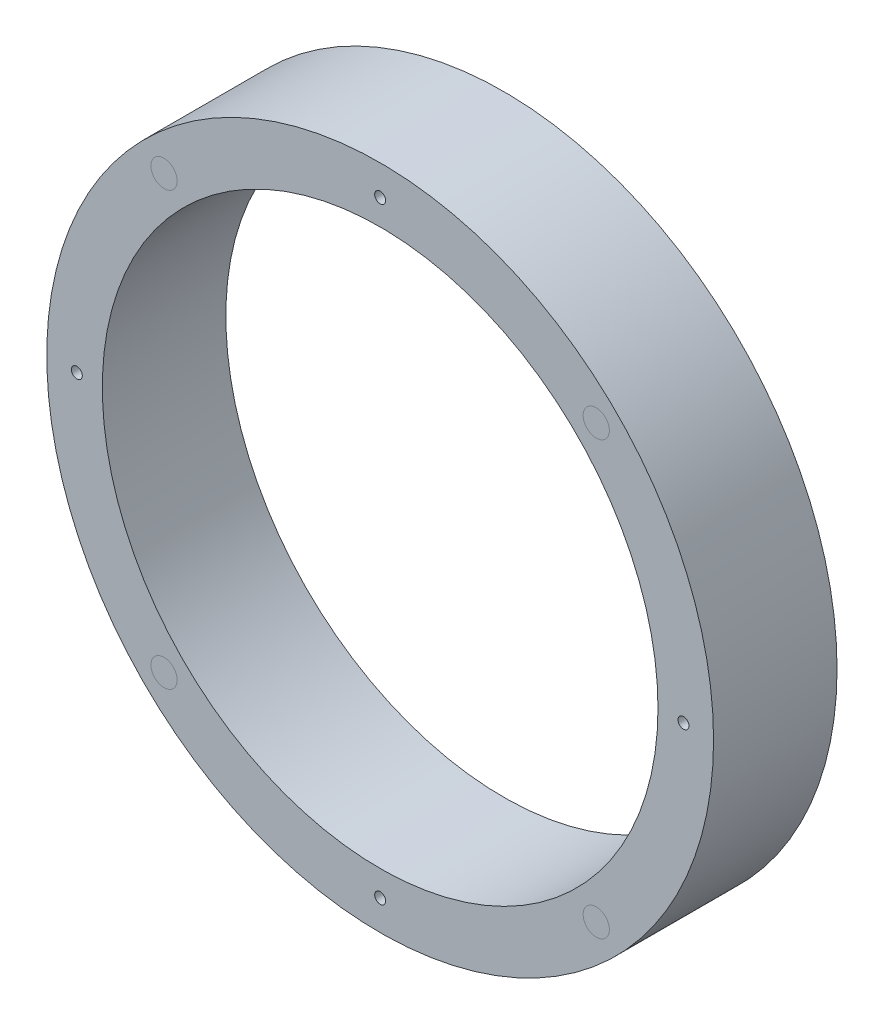
ISO-10303-21;
HEADER;
FILE_DESCRIPTION(('STEP AP214'),'2;1');
FILE_NAME('part.step','',(''),(''),'','','');
FILE_SCHEMA(('AUTOMOTIVE_DESIGN { 1 0 10303 214 1 1 1 1 }'));
ENDSEC;
DATA;
#1=APPLICATION_CONTEXT('core data for automotive mechanical design processes');
#2=APPLICATION_PROTOCOL_DEFINITION('international standard','automotive_design',2000,#1);
#3=PRODUCT_CONTEXT('',#1,'mechanical');
#4=PRODUCT('Part','Part','',(#3));
#5=PRODUCT_RELATED_PRODUCT_CATEGORY('part','',(#4));
#6=PRODUCT_DEFINITION_FORMATION('','',#4);
#7=PRODUCT_DEFINITION_CONTEXT('part definition',#1,'design');
#8=PRODUCT_DEFINITION('design','',#6,#7);
#9=PRODUCT_DEFINITION_SHAPE('','',#8);
#10=(LENGTH_UNIT() NAMED_UNIT(*) SI_UNIT(.MILLI.,.METRE.));
#11=(NAMED_UNIT(*) PLANE_ANGLE_UNIT() SI_UNIT($,.RADIAN.));
#12=(NAMED_UNIT(*) SI_UNIT($,.STERADIAN.) SOLID_ANGLE_UNIT());
#13=UNCERTAINTY_MEASURE_WITH_UNIT(LENGTH_MEASURE(1.E-05),#10,'distance_accuracy_value','');
#14=(GEOMETRIC_REPRESENTATION_CONTEXT(3) GLOBAL_UNCERTAINTY_ASSIGNED_CONTEXT((#13)) GLOBAL_UNIT_ASSIGNED_CONTEXT((#10,
#11,#12)) REPRESENTATION_CONTEXT('',''));
#15=CARTESIAN_POINT('',(0.,0.,0.));
#16=DIRECTION('',(0.,0.,1.));
#17=DIRECTION('',(1.,0.,0.));
#18=AXIS2_PLACEMENT_3D('',#15,#16,#17);
#19=CARTESIAN_POINT('',(-49.3914086658801,49.3914086658806,21.775));
#20=DIRECTION('',(0.,0.,1.));
#21=DIRECTION('',(1.,0.,0.));
#22=AXIS2_PLACEMENT_3D('',#19,#20,#21);
#23=CYLINDRICAL_SURFACE('',#22,3.);
#24=CARTESIAN_POINT('',(-49.3914086658801,49.3914086658806,21.775));
#25=DIRECTION('',(0.,0.,1.));
#26=DIRECTION('',(1.,0.,0.));
#27=AXIS2_PLACEMENT_3D('',#24,#25,#26);
#28=CIRCLE('',#27,3.);
#29=CARTESIAN_POINT('',(-46.3914086658801,49.3914086658806,21.775));
#30=VERTEX_POINT('',#29);
#31=EDGE_CURVE('E11',#30,#30,#28,.T.);
#32=ORIENTED_EDGE('',*,*,#31,.T.);
#33=EDGE_LOOP('',(#32));
#34=FACE_BOUND('',#33,.T.);
#35=CARTESIAN_POINT('',(-49.3914086658801,49.3914086658806,28.225));
#36=DIRECTION('',(0.,0.,1.));
#37=DIRECTION('',(1.,0.,0.));
#38=AXIS2_PLACEMENT_3D('',#35,#36,#37);
#39=CIRCLE('',#38,3.);
#40=CARTESIAN_POINT('',(-46.3914086658801,49.3914086658806,28.225));
#41=VERTEX_POINT('',#40);
#42=EDGE_CURVE('E43',#41,#41,#39,.T.);
#43=ORIENTED_EDGE('',*,*,#42,.F.);
#44=EDGE_LOOP('',(#43));
#45=FACE_BOUND('',#44,.T.);
#46=ADVANCED_FACE('F40',(#34,#45),#23,.T.);
#47=CARTESIAN_POINT('',(-49.3914086658801,49.3914086658806,21.775));
#48=DIRECTION('',(0.,0.,1.));
#49=DIRECTION('',(1.,0.,0.));
#50=AXIS2_PLACEMENT_3D('',#47,#48,#49);
#51=PLANE('',#50);
#52=ORIENTED_EDGE('',*,*,#31,.F.);
#53=EDGE_LOOP('',(#52));
#54=FACE_BOUND('',#53,.T.);
#55=ADVANCED_FACE('F55',(#54),#51,.F.);
#56=CARTESIAN_POINT('',(-49.3914086658801,49.3914086658806,28.225));
#57=DIRECTION('',(0.,0.,1.));
#58=DIRECTION('',(1.,0.,0.));
#59=AXIS2_PLACEMENT_3D('',#56,#57,#58);
#60=PLANE('',#59);
#61=ORIENTED_EDGE('',*,*,#42,.T.);
#62=EDGE_LOOP('',(#61));
#63=FACE_BOUND('',#62,.T.);
#64=ADVANCED_FACE('F52',(#63),#60,.T.);
#65=CLOSED_SHELL('',(#46,#55,#64));
#66=MANIFOLD_SOLID_BREP('B2',#65);
#67=CARTESIAN_POINT('',(49.3914086658806,49.3914086658829,21.775));
#68=DIRECTION('',(0.,0.,1.));
#69=DIRECTION('',(1.,0.,0.));
#70=AXIS2_PLACEMENT_3D('',#67,#68,#69);
#71=CYLINDRICAL_SURFACE('',#70,3.00000000000288);
#72=CARTESIAN_POINT('',(49.3914086658806,49.3914086658829,21.775));
#73=DIRECTION('',(0.,0.,1.));
#74=DIRECTION('',(1.,0.,0.));
#75=AXIS2_PLACEMENT_3D('',#72,#73,#74);
#76=CIRCLE('',#75,3.00000000000288);
#77=CARTESIAN_POINT('',(52.3914086658835,49.3914086658829,21.775));
#78=VERTEX_POINT('',#77);
#79=EDGE_CURVE('E39',#78,#78,#76,.T.);
#80=ORIENTED_EDGE('',*,*,#79,.T.);
#81=EDGE_LOOP('',(#80));
#82=FACE_BOUND('',#81,.T.);
#83=CARTESIAN_POINT('',(49.3914086658806,49.3914086658829,28.225));
#84=DIRECTION('',(0.,0.,1.));
#85=DIRECTION('',(1.,0.,0.));
#86=AXIS2_PLACEMENT_3D('',#83,#84,#85);
#87=CIRCLE('',#86,3.00000000000288);
#88=CARTESIAN_POINT('',(52.3914086658835,49.3914086658829,28.225));
#89=VERTEX_POINT('',#88);
#90=EDGE_CURVE('E92',#89,#89,#87,.T.);
#91=ORIENTED_EDGE('',*,*,#90,.F.);
#92=EDGE_LOOP('',(#91));
#93=FACE_BOUND('',#92,.T.);
#94=ADVANCED_FACE('F89',(#82,#93),#71,.T.);
#95=CARTESIAN_POINT('',(49.3914086658806,49.3914086658829,21.775));
#96=DIRECTION('',(0.,0.,1.));
#97=DIRECTION('',(1.,0.,0.));
#98=AXIS2_PLACEMENT_3D('',#95,#96,#97);
#99=PLANE('',#98);
#100=ORIENTED_EDGE('',*,*,#79,.F.);
#101=EDGE_LOOP('',(#100));
#102=FACE_BOUND('',#101,.T.);
#103=ADVANCED_FACE('F104',(#102),#99,.F.);
#104=CARTESIAN_POINT('',(49.3914086658806,49.3914086658829,28.225));
#105=DIRECTION('',(0.,0.,1.));
#106=DIRECTION('',(1.,0.,0.));
#107=AXIS2_PLACEMENT_3D('',#104,#105,#106);
#108=PLANE('',#107);
#109=ORIENTED_EDGE('',*,*,#90,.T.);
#110=EDGE_LOOP('',(#109));
#111=FACE_BOUND('',#110,.T.);
#112=ADVANCED_FACE('F101',(#111),#108,.T.);
#113=CLOSED_SHELL('',(#94,#103,#112));
#114=MANIFOLD_SOLID_BREP('B6',#113);
#115=CARTESIAN_POINT('',(49.3914086658829,-49.3914086658779,21.775));
#116=DIRECTION('',(0.,0.,1.));
#117=DIRECTION('',(1.,0.,0.));
#118=AXIS2_PLACEMENT_3D('',#115,#116,#117);
#119=CYLINDRICAL_SURFACE('',#118,3.00000000000392);
#120=CARTESIAN_POINT('',(49.3914086658829,-49.3914086658779,21.775));
#121=DIRECTION('',(0.,0.,1.));
#122=DIRECTION('',(1.,0.,0.));
#123=AXIS2_PLACEMENT_3D('',#120,#121,#122);
#124=CIRCLE('',#123,3.00000000000392);
#125=CARTESIAN_POINT('',(52.3914086658868,-49.3914086658779,21.775));
#126=VERTEX_POINT('',#125);
#127=EDGE_CURVE('E88',#126,#126,#124,.T.);
#128=ORIENTED_EDGE('',*,*,#127,.T.);
#129=EDGE_LOOP('',(#128));
#130=FACE_BOUND('',#129,.T.);
#131=CARTESIAN_POINT('',(49.3914086658829,-49.3914086658779,28.225));
#132=DIRECTION('',(0.,0.,1.));
#133=DIRECTION('',(1.,0.,0.));
#134=AXIS2_PLACEMENT_3D('',#131,#132,#133);
#135=CIRCLE('',#134,3.00000000000392);
#136=CARTESIAN_POINT('',(52.3914086658868,-49.3914086658779,28.225));
#137=VERTEX_POINT('',#136);
#138=EDGE_CURVE('E141',#137,#137,#135,.T.);
#139=ORIENTED_EDGE('',*,*,#138,.F.);
#140=EDGE_LOOP('',(#139));
#141=FACE_BOUND('',#140,.T.);
#142=ADVANCED_FACE('F138',(#130,#141),#119,.T.);
#143=CARTESIAN_POINT('',(49.3914086658829,-49.3914086658779,21.775));
#144=DIRECTION('',(0.,0.,1.));
#145=DIRECTION('',(1.,0.,0.));
#146=AXIS2_PLACEMENT_3D('',#143,#144,#145);
#147=PLANE('',#146);
#148=ORIENTED_EDGE('',*,*,#127,.F.);
#149=EDGE_LOOP('',(#148));
#150=FACE_BOUND('',#149,.T.);
#151=ADVANCED_FACE('F153',(#150),#147,.F.);
#152=CARTESIAN_POINT('',(49.3914086658829,-49.3914086658779,28.225));
#153=DIRECTION('',(0.,0.,1.));
#154=DIRECTION('',(1.,0.,0.));
#155=AXIS2_PLACEMENT_3D('',#152,#153,#154);
#156=PLANE('',#155);
#157=ORIENTED_EDGE('',*,*,#138,.T.);
#158=EDGE_LOOP('',(#157));
#159=FACE_BOUND('',#158,.T.);
#160=ADVANCED_FACE('F150',(#159),#156,.T.);
#161=CLOSED_SHELL('',(#142,#151,#160));
#162=MANIFOLD_SOLID_BREP('B34',#161);
#163=CARTESIAN_POINT('',(-49.3914086658778,-49.3914086658801,21.775));
#164=DIRECTION('',(0.,0.,1.));
#165=DIRECTION('',(1.,0.,0.));
#166=AXIS2_PLACEMENT_3D('',#163,#164,#165);
#167=CYLINDRICAL_SURFACE('',#166,3.0000000000015);
#168=CARTESIAN_POINT('',(-49.3914086658778,-49.3914086658801,21.775));
#169=DIRECTION('',(0.,0.,1.));
#170=DIRECTION('',(1.,0.,0.));
#171=AXIS2_PLACEMENT_3D('',#168,#169,#170);
#172=CIRCLE('',#171,3.0000000000015);
#173=CARTESIAN_POINT('',(-46.3914086658763,-49.3914086658801,21.775));
#174=VERTEX_POINT('',#173);
#175=EDGE_CURVE('E137',#174,#174,#172,.T.);
#176=ORIENTED_EDGE('',*,*,#175,.T.);
#177=EDGE_LOOP('',(#176));
#178=FACE_BOUND('',#177,.T.);
#179=CARTESIAN_POINT('',(-49.3914086658778,-49.3914086658801,28.225));
#180=DIRECTION('',(0.,0.,1.));
#181=DIRECTION('',(1.,0.,0.));
#182=AXIS2_PLACEMENT_3D('',#179,#180,#181);
#183=CIRCLE('',#182,3.0000000000015);
#184=CARTESIAN_POINT('',(-46.3914086658763,-49.3914086658801,28.225));
#185=VERTEX_POINT('',#184);
#186=EDGE_CURVE('E189',#185,#185,#183,.T.);
#187=ORIENTED_EDGE('',*,*,#186,.F.);
#188=EDGE_LOOP('',(#187));
#189=FACE_BOUND('',#188,.T.);
#190=ADVANCED_FACE('F186',(#178,#189),#167,.T.);
#191=CARTESIAN_POINT('',(-49.3914086658778,-49.3914086658801,21.775));
#192=DIRECTION('',(0.,0.,1.));
#193=DIRECTION('',(1.,0.,0.));
#194=AXIS2_PLACEMENT_3D('',#191,#192,#193);
#195=PLANE('',#194);
#196=ORIENTED_EDGE('',*,*,#175,.F.);
#197=EDGE_LOOP('',(#196));
#198=FACE_BOUND('',#197,.T.);
#199=ADVANCED_FACE('F201',(#198),#195,.F.);
#200=CARTESIAN_POINT('',(-49.3914086658778,-49.3914086658801,28.225));
#201=DIRECTION('',(0.,0.,1.));
#202=DIRECTION('',(1.,0.,0.));
#203=AXIS2_PLACEMENT_3D('',#200,#201,#202);
#204=PLANE('',#203);
#205=ORIENTED_EDGE('',*,*,#186,.T.);
#206=EDGE_LOOP('',(#205));
#207=FACE_BOUND('',#206,.T.);
#208=ADVANCED_FACE('F198',(#207),#204,.T.);
#209=CLOSED_SHELL('',(#190,#199,#208));
#210=MANIFOLD_SOLID_BREP('B83',#209);
#211=CARTESIAN_POINT('',(0.,69.3225,28.225));
#212=DIRECTION('',(0.,0.,-1.));
#213=DIRECTION('',(-1.,0.,0.));
#214=AXIS2_PLACEMENT_3D('',#211,#212,#213);
#215=CYLINDRICAL_SURFACE('',#214,1.25);
#216=CARTESIAN_POINT('',(0.,69.3225,28.225));
#217=DIRECTION('',(0.,0.,1.));
#218=DIRECTION('',(1.,0.,0.));
#219=AXIS2_PLACEMENT_3D('',#216,#217,#218);
#220=CIRCLE('',#219,1.25);
#221=CARTESIAN_POINT('',(1.25,69.3225,28.225));
#222=VERTEX_POINT('',#221);
#223=EDGE_CURVE('E274',#222,#222,#220,.T.);
#224=ORIENTED_EDGE('',*,*,#223,.T.);
#225=EDGE_LOOP('',(#224));
#226=FACE_BOUND('',#225,.T.);
#227=CARTESIAN_POINT('',(0.,69.3225,6.725));
#228=DIRECTION('',(0.,0.,-1.));
#229=DIRECTION('',(-1.,0.,0.));
#230=AXIS2_PLACEMENT_3D('',#227,#228,#229);
#231=CIRCLE('',#230,1.25);
#232=CARTESIAN_POINT('',(-1.25,69.3225,6.725));
#233=VERTEX_POINT('',#232);
#234=EDGE_CURVE('E231',#233,#233,#231,.T.);
#235=ORIENTED_EDGE('',*,*,#234,.T.);
#236=EDGE_LOOP('',(#235));
#237=FACE_BOUND('',#236,.T.);
#238=ADVANCED_FACE('F227',(#226,#237),#215,.F.);
#239=CARTESIAN_POINT('',(69.322500000002,1.97239286681633E-12,28.225));
#240=DIRECTION('',(0.,0.,-1.));
#241=DIRECTION('',(-1.,0.,0.));
#242=AXIS2_PLACEMENT_3D('',#239,#240,#241);
#243=CYLINDRICAL_SURFACE('',#242,1.25);
#244=CARTESIAN_POINT('',(69.322500000002,1.97239286681633E-12,28.225));
#245=DIRECTION('',(0.,0.,1.));
#246=DIRECTION('',(1.,0.,0.));
#247=AXIS2_PLACEMENT_3D('',#244,#245,#246);
#248=CIRCLE('',#247,1.25);
#249=CARTESIAN_POINT('',(70.572500000002,1.97239286681633E-12,28.225));
#250=VERTEX_POINT('',#249);
#251=EDGE_CURVE('E266',#250,#250,#248,.T.);
#252=ORIENTED_EDGE('',*,*,#251,.T.);
#253=EDGE_LOOP('',(#252));
#254=FACE_BOUND('',#253,.T.);
#255=CARTESIAN_POINT('',(69.322500000002,1.97239286681633E-12,6.725));
#256=DIRECTION('',(0.,0.,-1.));
#257=DIRECTION('',(-1.,0.,0.));
#258=AXIS2_PLACEMENT_3D('',#255,#256,#257);
#259=CIRCLE('',#258,1.25);
#260=CARTESIAN_POINT('',(68.072500000002,1.97239286681633E-12,6.725));
#261=VERTEX_POINT('',#260);
#262=EDGE_CURVE('E252',#261,#261,#259,.T.);
#263=ORIENTED_EDGE('',*,*,#262,.T.);
#264=EDGE_LOOP('',(#263));
#265=FACE_BOUND('',#264,.T.);
#266=ADVANCED_FACE('F299',(#254,#265),#243,.F.);
#267=CARTESIAN_POINT('',(3.94478573363265E-12,-69.3225,28.225));
#268=DIRECTION('',(0.,0.,-1.));
#269=DIRECTION('',(-1.,0.,0.));
#270=AXIS2_PLACEMENT_3D('',#267,#268,#269);
#271=CYLINDRICAL_SURFACE('',#270,1.25);
#272=CARTESIAN_POINT('',(3.94478573363265E-12,-69.3225,28.225));
#273=DIRECTION('',(0.,0.,1.));
#274=DIRECTION('',(1.,0.,0.));
#275=AXIS2_PLACEMENT_3D('',#272,#273,#274);
#276=CIRCLE('',#275,1.25);
#277=CARTESIAN_POINT('',(1.25000000000395,-69.3225,28.225));
#278=VERTEX_POINT('',#277);
#279=EDGE_CURVE('E261',#278,#278,#276,.T.);
#280=ORIENTED_EDGE('',*,*,#279,.T.);
#281=EDGE_LOOP('',(#280));
#282=FACE_BOUND('',#281,.T.);
#283=CARTESIAN_POINT('',(3.94478573363265E-12,-69.3225,6.725));
#284=DIRECTION('',(0.,0.,-1.));
#285=DIRECTION('',(-1.,0.,0.));
#286=AXIS2_PLACEMENT_3D('',#283,#284,#285);
#287=CIRCLE('',#286,1.25);
#288=CARTESIAN_POINT('',(-1.24999999999606,-69.3225,6.725));
#289=VERTEX_POINT('',#288);
#290=EDGE_CURVE('E249',#289,#289,#287,.T.);
#291=ORIENTED_EDGE('',*,*,#290,.T.);
#292=EDGE_LOOP('',(#291));
#293=FACE_BOUND('',#292,.T.);
#294=ADVANCED_FACE('F304',(#282,#293),#271,.F.);
#295=CARTESIAN_POINT('',(-69.322499999998,-1.98088242458971E-12,28.225));
#296=DIRECTION('',(0.,0.,-1.));
#297=DIRECTION('',(-1.,0.,0.));
#298=AXIS2_PLACEMENT_3D('',#295,#296,#297);
#299=CYLINDRICAL_SURFACE('',#298,1.25);
#300=CARTESIAN_POINT('',(-69.322499999998,-1.98088242458971E-12,28.225));
#301=DIRECTION('',(0.,0.,1.));
#302=DIRECTION('',(1.,0.,0.));
#303=AXIS2_PLACEMENT_3D('',#300,#301,#302);
#304=CIRCLE('',#303,1.25);
#305=CARTESIAN_POINT('',(-68.072499999998,-1.98088242458971E-12,28.225));
#306=VERTEX_POINT('',#305);
#307=EDGE_CURVE('E257',#306,#306,#304,.T.);
#308=ORIENTED_EDGE('',*,*,#307,.T.);
#309=EDGE_LOOP('',(#308));
#310=FACE_BOUND('',#309,.T.);
#311=CARTESIAN_POINT('',(-69.322499999998,-1.98088242458971E-12,6.725));
#312=DIRECTION('',(0.,0.,-1.));
#313=DIRECTION('',(-1.,0.,0.));
#314=AXIS2_PLACEMENT_3D('',#311,#312,#313);
#315=CIRCLE('',#314,1.25);
#316=CARTESIAN_POINT('',(-70.572499999998,-1.98088242458971E-12,6.725));
#317=VERTEX_POINT('',#316);
#318=EDGE_CURVE('E246',#317,#317,#315,.T.);
#319=ORIENTED_EDGE('',*,*,#318,.T.);
#320=EDGE_LOOP('',(#319));
#321=FACE_BOUND('',#320,.T.);
#322=ADVANCED_FACE('F310',(#310,#321),#299,.F.);
#323=CARTESIAN_POINT('',(0.,0.,28.225));
#324=DIRECTION('',(0.,0.,1.));
#325=DIRECTION('',(1.,0.,0.));
#326=AXIS2_PLACEMENT_3D('',#323,#324,#325);
#327=PLANE('',#326);
#328=CARTESIAN_POINT('',(-49.3914086658778,-49.3914086658801,28.225));
#329=DIRECTION('',(0.,0.,1.));
#330=DIRECTION('',(1.,0.,0.));
#331=AXIS2_PLACEMENT_3D('',#328,#329,#330);
#332=CIRCLE('',#331,3.0000000000015);
#333=CARTESIAN_POINT('',(-46.3914086658763,-49.3914086658801,28.225));
#334=VERTEX_POINT('',#333);
#335=EDGE_CURVE('E380',#334,#334,#332,.T.);
#336=ORIENTED_EDGE('',*,*,#335,.F.);
#337=EDGE_LOOP('',(#336));
#338=FACE_BOUND('',#337,.T.);
#339=CARTESIAN_POINT('',(49.3914086658829,-49.3914086658779,28.225));
#340=DIRECTION('',(0.,0.,1.));
#341=DIRECTION('',(1.,0.,0.));
#342=AXIS2_PLACEMENT_3D('',#339,#340,#341);
#343=CIRCLE('',#342,3.00000000000392);
#344=CARTESIAN_POINT('',(52.3914086658868,-49.3914086658779,28.225));
#345=VERTEX_POINT('',#344);
#346=EDGE_CURVE('E372',#345,#345,#343,.T.);
#347=ORIENTED_EDGE('',*,*,#346,.F.);
#348=EDGE_LOOP('',(#347));
#349=FACE_BOUND('',#348,.T.);
#350=CARTESIAN_POINT('',(49.3914086658806,49.3914086658829,28.225));
#351=DIRECTION('',(0.,0.,1.));
#352=DIRECTION('',(1.,0.,0.));
#353=AXIS2_PLACEMENT_3D('',#350,#351,#352);
#354=CIRCLE('',#353,3.00000000000287);
#355=CARTESIAN_POINT('',(52.3914086658835,49.3914086658829,28.225));
#356=VERTEX_POINT('',#355);
#357=EDGE_CURVE('E365',#356,#356,#354,.T.);
#358=ORIENTED_EDGE('',*,*,#357,.F.);
#359=EDGE_LOOP('',(#358));
#360=FACE_BOUND('',#359,.T.);
#361=CARTESIAN_POINT('',(-49.3914086658801,49.3914086658806,28.225));
#362=DIRECTION('',(0.,0.,1.));
#363=DIRECTION('',(1.,0.,0.));
#364=AXIS2_PLACEMENT_3D('',#361,#362,#363);
#365=CIRCLE('',#364,3.);
#366=CARTESIAN_POINT('',(-46.3914086658801,49.3914086658806,28.225));
#367=VERTEX_POINT('',#366);
#368=EDGE_CURVE('E369',#367,#367,#365,.T.);
#369=ORIENTED_EDGE('',*,*,#368,.F.);
#370=EDGE_LOOP('',(#369));
#371=FACE_BOUND('',#370,.T.);
#372=ORIENTED_EDGE('',*,*,#279,.F.);
#373=EDGE_LOOP('',(#372));
#374=FACE_BOUND('',#373,.T.);
#375=ORIENTED_EDGE('',*,*,#223,.F.);
#376=EDGE_LOOP('',(#375));
#377=FACE_BOUND('',#376,.T.);
#378=CARTESIAN_POINT('',(0.,0.,28.225));
#379=DIRECTION('',(0.,0.,1.));
#380=DIRECTION('',(1.,0.,0.));
#381=AXIS2_PLACEMENT_3D('',#378,#379,#380);
#382=CIRCLE('',#381,76.2);
#383=CARTESIAN_POINT('',(76.2,0.,28.225));
#384=VERTEX_POINT('',#383);
#385=EDGE_CURVE('E185',#384,#384,#382,.T.);
#386=ORIENTED_EDGE('',*,*,#385,.T.);
#387=EDGE_LOOP('',(#386));
#388=FACE_BOUND('',#387,.T.);
#389=CARTESIAN_POINT('',(0.,0.,28.225));
#390=DIRECTION('',(0.,0.,1.));
#391=DIRECTION('',(1.,0.,0.));
#392=AXIS2_PLACEMENT_3D('',#389,#390,#391);
#393=CIRCLE('',#392,63.5);
#394=CARTESIAN_POINT('',(63.5,0.,28.225));
#395=VERTEX_POINT('',#394);
#396=EDGE_CURVE('E240',#395,#395,#393,.T.);
#397=ORIENTED_EDGE('',*,*,#396,.F.);
#398=EDGE_LOOP('',(#397));
#399=FACE_BOUND('',#398,.T.);
#400=ORIENTED_EDGE('',*,*,#251,.F.);
#401=EDGE_LOOP('',(#400));
#402=FACE_BOUND('',#401,.T.);
#403=ORIENTED_EDGE('',*,*,#307,.F.);
#404=EDGE_LOOP('',(#403));
#405=FACE_BOUND('',#404,.T.);
#406=ADVANCED_FACE('F314',(#338,#349,#360,#371,#374,#377,#388,#399,#402,#405),#327,.T.);
#407=CARTESIAN_POINT('',(0.,0.,0.));
#408=DIRECTION('',(0.,0.,1.));
#409=DIRECTION('',(1.,0.,0.));
#410=AXIS2_PLACEMENT_3D('',#407,#408,#409);
#411=PLANE('',#410);
#412=CARTESIAN_POINT('',(-49.3914086658778,-49.3914086658801,0.));
#413=DIRECTION('',(0.,0.,1.));
#414=DIRECTION('',(1.,0.,0.));
#415=AXIS2_PLACEMENT_3D('',#412,#413,#414);
#416=CIRCLE('',#415,3.0000000000015);
#417=CARTESIAN_POINT('',(-46.3914086658763,-49.3914086658801,0.));
#418=VERTEX_POINT('',#417);
#419=EDGE_CURVE('E377',#418,#418,#416,.T.);
#420=ORIENTED_EDGE('',*,*,#419,.T.);
#421=EDGE_LOOP('',(#420));
#422=FACE_BOUND('',#421,.T.);
#423=CARTESIAN_POINT('',(49.3914086658829,-49.3914086658779,0.));
#424=DIRECTION('',(0.,0.,1.));
#425=DIRECTION('',(1.,0.,0.));
#426=AXIS2_PLACEMENT_3D('',#423,#424,#425);
#427=CIRCLE('',#426,3.00000000000392);
#428=CARTESIAN_POINT('',(52.3914086658868,-49.3914086658779,0.));
#429=VERTEX_POINT('',#428);
#430=EDGE_CURVE('E367',#429,#429,#427,.T.);
#431=ORIENTED_EDGE('',*,*,#430,.T.);
#432=EDGE_LOOP('',(#431));
#433=FACE_BOUND('',#432,.T.);
#434=CARTESIAN_POINT('',(49.3914086658806,49.3914086658829,0.));
#435=DIRECTION('',(0.,0.,1.));
#436=DIRECTION('',(1.,0.,0.));
#437=AXIS2_PLACEMENT_3D('',#434,#435,#436);
#438=CIRCLE('',#437,3.00000000000287);
#439=CARTESIAN_POINT('',(52.3914086658835,49.3914086658829,0.));
#440=VERTEX_POINT('',#439);
#441=EDGE_CURVE('E362',#440,#440,#438,.T.);
#442=ORIENTED_EDGE('',*,*,#441,.T.);
#443=EDGE_LOOP('',(#442));
#444=FACE_BOUND('',#443,.T.);
#445=CARTESIAN_POINT('',(-49.3914086658801,49.3914086658806,0.));
#446=DIRECTION('',(0.,0.,1.));
#447=DIRECTION('',(1.,0.,0.));
#448=AXIS2_PLACEMENT_3D('',#445,#446,#447);
#449=CIRCLE('',#448,3.);
#450=CARTESIAN_POINT('',(-46.3914086658801,49.3914086658806,0.));
#451=VERTEX_POINT('',#450);
#452=EDGE_CURVE('E383',#451,#451,#449,.T.);
#453=ORIENTED_EDGE('',*,*,#452,.T.);
#454=EDGE_LOOP('',(#453));
#455=FACE_BOUND('',#454,.T.);
#456=CARTESIAN_POINT('',(0.,69.3225,0.));
#457=DIRECTION('',(0.,0.,-1.));
#458=DIRECTION('',(-1.,0.,0.));
#459=AXIS2_PLACEMENT_3D('',#456,#457,#458);
#460=CIRCLE('',#459,2.5);
#461=CARTESIAN_POINT('',(-2.5,69.3225,0.));
#462=VERTEX_POINT('',#461);
#463=EDGE_CURVE('E390',#462,#462,#460,.T.);
#464=ORIENTED_EDGE('',*,*,#463,.F.);
#465=EDGE_LOOP('',(#464));
#466=FACE_BOUND('',#465,.T.);
#467=CARTESIAN_POINT('',(-69.322499999998,-1.98088226187722E-12,0.));
#468=DIRECTION('',(0.,0.,-1.));
#469=DIRECTION('',(-1.,0.,0.));
#470=AXIS2_PLACEMENT_3D('',#467,#468,#469);
#471=CIRCLE('',#470,2.5);
#472=CARTESIAN_POINT('',(-71.822499999998,-1.98088226187722E-12,0.));
#473=VERTEX_POINT('',#472);
#474=EDGE_CURVE('E396',#473,#473,#471,.T.);
#475=ORIENTED_EDGE('',*,*,#474,.F.);
#476=EDGE_LOOP('',(#475));
#477=FACE_BOUND('',#476,.T.);
#478=CARTESIAN_POINT('',(3.96286736065177E-12,-69.3225,0.));
#479=DIRECTION('',(0.,0.,-1.));
#480=DIRECTION('',(-1.,0.,0.));
#481=AXIS2_PLACEMENT_3D('',#478,#479,#480);
#482=CIRCLE('',#481,2.5);
#483=CARTESIAN_POINT('',(-2.49999999999604,-69.3225,0.));
#484=VERTEX_POINT('',#483);
#485=EDGE_CURVE('E402',#484,#484,#482,.T.);
#486=ORIENTED_EDGE('',*,*,#485,.F.);
#487=EDGE_LOOP('',(#486));
#488=FACE_BOUND('',#487,.T.);
#489=CARTESIAN_POINT('',(69.322500000002,1.97238059218563E-12,0.));
#490=DIRECTION('',(0.,0.,-1.));
#491=DIRECTION('',(-1.,0.,0.));
#492=AXIS2_PLACEMENT_3D('',#489,#490,#491);
#493=CIRCLE('',#492,2.5);
#494=CARTESIAN_POINT('',(66.822500000002,1.97238059218563E-12,0.));
#495=VERTEX_POINT('',#494);
#496=EDGE_CURVE('E269',#495,#495,#493,.T.);
#497=ORIENTED_EDGE('',*,*,#496,.F.);
#498=EDGE_LOOP('',(#497));
#499=FACE_BOUND('',#498,.T.);
#500=CARTESIAN_POINT('',(0.,0.,0.));
#501=DIRECTION('',(0.,0.,1.));
#502=DIRECTION('',(1.,0.,0.));
#503=AXIS2_PLACEMENT_3D('',#500,#501,#502);
#504=CIRCLE('',#503,76.2);
#505=CARTESIAN_POINT('',(76.2,0.,0.));
#506=VERTEX_POINT('',#505);
#507=EDGE_CURVE('E235',#506,#506,#504,.T.);
#508=ORIENTED_EDGE('',*,*,#507,.F.);
#509=EDGE_LOOP('',(#508));
#510=FACE_BOUND('',#509,.T.);
#511=CARTESIAN_POINT('',(0.,0.,0.));
#512=DIRECTION('',(0.,0.,1.));
#513=DIRECTION('',(1.,0.,0.));
#514=AXIS2_PLACEMENT_3D('',#511,#512,#513);
#515=CIRCLE('',#514,63.5);
#516=CARTESIAN_POINT('',(63.5,0.,0.));
#517=VERTEX_POINT('',#516);
#518=EDGE_CURVE('E243',#517,#517,#515,.T.);
#519=ORIENTED_EDGE('',*,*,#518,.T.);
#520=EDGE_LOOP('',(#519));
#521=FACE_BOUND('',#520,.T.);
#522=ADVANCED_FACE('F282',(#422,#433,#444,#455,#466,#477,#488,#499,#510,#521),#411,.F.);
#523=CARTESIAN_POINT('',(0.,0.,28.225));
#524=DIRECTION('',(0.,0.,-1.));
#525=DIRECTION('',(-1.,0.,0.));
#526=AXIS2_PLACEMENT_3D('',#523,#524,#525);
#527=CYLINDRICAL_SURFACE('',#526,76.2);
#528=ORIENTED_EDGE('',*,*,#385,.F.);
#529=EDGE_LOOP('',(#528));
#530=FACE_BOUND('',#529,.T.);
#531=ORIENTED_EDGE('',*,*,#507,.T.);
#532=EDGE_LOOP('',(#531));
#533=FACE_BOUND('',#532,.T.);
#534=ADVANCED_FACE('F229',(#530,#533),#527,.T.);
#535=CARTESIAN_POINT('',(0.,0.,28.225));
#536=DIRECTION('',(0.,0.,-1.));
#537=DIRECTION('',(-1.,0.,0.));
#538=AXIS2_PLACEMENT_3D('',#535,#536,#537);
#539=CYLINDRICAL_SURFACE('',#538,63.5);
#540=ORIENTED_EDGE('',*,*,#396,.T.);
#541=EDGE_LOOP('',(#540));
#542=FACE_BOUND('',#541,.T.);
#543=ORIENTED_EDGE('',*,*,#518,.F.);
#544=EDGE_LOOP('',(#543));
#545=FACE_BOUND('',#544,.T.);
#546=ADVANCED_FACE('F284',(#542,#545),#539,.F.);
#547=CARTESIAN_POINT('',(-69.322499999998,-1.98088226187722E-12,6.725));
#548=DIRECTION('',(0.,0.,-1.));
#549=DIRECTION('',(-1.,0.,0.));
#550=AXIS2_PLACEMENT_3D('',#547,#548,#549);
#551=CYLINDRICAL_SURFACE('',#550,2.5);
#552=CARTESIAN_POINT('',(-69.322499999998,-1.98088226187722E-12,6.725));
#553=DIRECTION('',(0.,0.,-1.));
#554=DIRECTION('',(-1.,0.,0.));
#555=AXIS2_PLACEMENT_3D('',#552,#553,#554);
#556=CIRCLE('',#555,2.5);
#557=CARTESIAN_POINT('',(-71.822499999998,-1.98088226187722E-12,6.725));
#558=VERTEX_POINT('',#557);
#559=EDGE_CURVE('E393',#558,#558,#556,.T.);
#560=ORIENTED_EDGE('',*,*,#559,.F.);
#561=EDGE_LOOP('',(#560));
#562=FACE_BOUND('',#561,.T.);
#563=ORIENTED_EDGE('',*,*,#474,.T.);
#564=EDGE_LOOP('',(#563));
#565=FACE_BOUND('',#564,.T.);
#566=ADVANCED_FACE('F286',(#562,#565),#551,.F.);
#567=CARTESIAN_POINT('',(-69.322499999998,-1.98088226187722E-12,6.725));
#568=DIRECTION('',(0.,0.,-1.));
#569=DIRECTION('',(-1.,0.,0.));
#570=AXIS2_PLACEMENT_3D('',#567,#568,#569);
#571=PLANE('',#570);
#572=ORIENTED_EDGE('',*,*,#318,.F.);
#573=EDGE_LOOP('',(#572));
#574=FACE_BOUND('',#573,.T.);
#575=ORIENTED_EDGE('',*,*,#559,.T.);
#576=EDGE_LOOP('',(#575));
#577=FACE_BOUND('',#576,.T.);
#578=ADVANCED_FACE('F292',(#574,#577),#571,.T.);
#579=CARTESIAN_POINT('',(3.96286736065177E-12,-69.3225,6.725));
#580=DIRECTION('',(0.,0.,-1.));
#581=DIRECTION('',(-1.,0.,0.));
#582=AXIS2_PLACEMENT_3D('',#579,#580,#581);
#583=CYLINDRICAL_SURFACE('',#582,2.5);
#584=CARTESIAN_POINT('',(3.96286736065177E-12,-69.3225,6.725));
#585=DIRECTION('',(0.,0.,-1.));
#586=DIRECTION('',(-1.,0.,0.));
#587=AXIS2_PLACEMENT_3D('',#584,#585,#586);
#588=CIRCLE('',#587,2.5);
#589=CARTESIAN_POINT('',(-2.49999999999604,-69.3225,6.725));
#590=VERTEX_POINT('',#589);
#591=EDGE_CURVE('E399',#590,#590,#588,.T.);
#592=ORIENTED_EDGE('',*,*,#591,.F.);
#593=EDGE_LOOP('',(#592));
#594=FACE_BOUND('',#593,.T.);
#595=ORIENTED_EDGE('',*,*,#485,.T.);
#596=EDGE_LOOP('',(#595));
#597=FACE_BOUND('',#596,.T.);
#598=ADVANCED_FACE('F325',(#594,#597),#583,.F.);
#599=CARTESIAN_POINT('',(3.96286736065177E-12,-69.3225,6.725));
#600=DIRECTION('',(0.,0.,-1.));
#601=DIRECTION('',(-1.,0.,0.));
#602=AXIS2_PLACEMENT_3D('',#599,#600,#601);
#603=PLANE('',#602);
#604=ORIENTED_EDGE('',*,*,#290,.F.);
#605=EDGE_LOOP('',(#604));
#606=FACE_BOUND('',#605,.T.);
#607=ORIENTED_EDGE('',*,*,#591,.T.);
#608=EDGE_LOOP('',(#607));
#609=FACE_BOUND('',#608,.T.);
#610=ADVANCED_FACE('F319',(#606,#609),#603,.T.);
#611=CARTESIAN_POINT('',(69.322500000002,1.97238059218563E-12,6.725));
#612=DIRECTION('',(0.,0.,-1.));
#613=DIRECTION('',(-1.,0.,0.));
#614=AXIS2_PLACEMENT_3D('',#611,#612,#613);
#615=CYLINDRICAL_SURFACE('',#614,2.5);
#616=CARTESIAN_POINT('',(69.322500000002,1.97238059218563E-12,6.725));
#617=DIRECTION('',(0.,0.,-1.));
#618=DIRECTION('',(-1.,0.,0.));
#619=AXIS2_PLACEMENT_3D('',#616,#617,#618);
#620=CIRCLE('',#619,2.5);
#621=CARTESIAN_POINT('',(66.822500000002,1.97238059218563E-12,6.725));
#622=VERTEX_POINT('',#621);
#623=EDGE_CURVE('E404',#622,#622,#620,.T.);
#624=ORIENTED_EDGE('',*,*,#623,.F.);
#625=EDGE_LOOP('',(#624));
#626=FACE_BOUND('',#625,.T.);
#627=ORIENTED_EDGE('',*,*,#496,.T.);
#628=EDGE_LOOP('',(#627));
#629=FACE_BOUND('',#628,.T.);
#630=ADVANCED_FACE('F315',(#626,#629),#615,.F.);
#631=CARTESIAN_POINT('',(69.322500000002,1.97238059218563E-12,6.725));
#632=DIRECTION('',(0.,0.,-1.));
#633=DIRECTION('',(-1.,0.,0.));
#634=AXIS2_PLACEMENT_3D('',#631,#632,#633);
#635=PLANE('',#634);
#636=ORIENTED_EDGE('',*,*,#262,.F.);
#637=EDGE_LOOP('',(#636));
#638=FACE_BOUND('',#637,.T.);
#639=ORIENTED_EDGE('',*,*,#623,.T.);
#640=EDGE_LOOP('',(#639));
#641=FACE_BOUND('',#640,.T.);
#642=ADVANCED_FACE('F318',(#638,#641),#635,.T.);
#643=CARTESIAN_POINT('',(0.,69.3225,6.725));
#644=DIRECTION('',(0.,0.,-1.));
#645=DIRECTION('',(-1.,0.,0.));
#646=AXIS2_PLACEMENT_3D('',#643,#644,#645);
#647=CYLINDRICAL_SURFACE('',#646,2.5);
#648=CARTESIAN_POINT('',(0.,69.3225,6.725));
#649=DIRECTION('',(0.,0.,-1.));
#650=DIRECTION('',(-1.,0.,0.));
#651=AXIS2_PLACEMENT_3D('',#648,#649,#650);
#652=CIRCLE('',#651,2.5);
#653=CARTESIAN_POINT('',(-2.5,69.3225,6.725));
#654=VERTEX_POINT('',#653);
#655=EDGE_CURVE('E250',#654,#654,#652,.T.);
#656=ORIENTED_EDGE('',*,*,#655,.F.);
#657=EDGE_LOOP('',(#656));
#658=FACE_BOUND('',#657,.T.);
#659=ORIENTED_EDGE('',*,*,#463,.T.);
#660=EDGE_LOOP('',(#659));
#661=FACE_BOUND('',#660,.T.);
#662=ADVANCED_FACE('F323',(#658,#661),#647,.F.);
#663=CARTESIAN_POINT('',(0.,69.3225,6.725));
#664=DIRECTION('',(0.,0.,-1.));
#665=DIRECTION('',(-1.,0.,0.));
#666=AXIS2_PLACEMENT_3D('',#663,#664,#665);
#667=PLANE('',#666);
#668=ORIENTED_EDGE('',*,*,#234,.F.);
#669=EDGE_LOOP('',(#668));
#670=FACE_BOUND('',#669,.T.);
#671=ORIENTED_EDGE('',*,*,#655,.T.);
#672=EDGE_LOOP('',(#671));
#673=FACE_BOUND('',#672,.T.);
#674=ADVANCED_FACE('F337',(#670,#673),#667,.T.);
#675=CARTESIAN_POINT('',(-49.3914086658801,49.3914086658806,0.));
#676=DIRECTION('',(0.,0.,1.));
#677=DIRECTION('',(1.,0.,0.));
#678=AXIS2_PLACEMENT_3D('',#675,#676,#677);
#679=CYLINDRICAL_SURFACE('',#678,3.);
#680=ORIENTED_EDGE('',*,*,#452,.F.);
#681=EDGE_LOOP('',(#680));
#682=FACE_BOUND('',#681,.T.);
#683=ORIENTED_EDGE('',*,*,#368,.T.);
#684=EDGE_LOOP('',(#683));
#685=FACE_BOUND('',#684,.T.);
#686=ADVANCED_FACE('F341',(#682,#685),#679,.F.);
#687=CARTESIAN_POINT('',(49.3914086658806,49.3914086658829,0.));
#688=DIRECTION('',(0.,0.,1.));
#689=DIRECTION('',(1.,0.,0.));
#690=AXIS2_PLACEMENT_3D('',#687,#688,#689);
#691=CYLINDRICAL_SURFACE('',#690,3.00000000000287);
#692=ORIENTED_EDGE('',*,*,#441,.F.);
#693=EDGE_LOOP('',(#692));
#694=FACE_BOUND('',#693,.T.);
#695=ORIENTED_EDGE('',*,*,#357,.T.);
#696=EDGE_LOOP('',(#695));
#697=FACE_BOUND('',#696,.T.);
#698=ADVANCED_FACE('F345',(#694,#697),#691,.F.);
#699=CARTESIAN_POINT('',(49.3914086658829,-49.3914086658779,0.));
#700=DIRECTION('',(0.,0.,1.));
#701=DIRECTION('',(1.,0.,0.));
#702=AXIS2_PLACEMENT_3D('',#699,#700,#701);
#703=CYLINDRICAL_SURFACE('',#702,3.00000000000392);
#704=ORIENTED_EDGE('',*,*,#430,.F.);
#705=EDGE_LOOP('',(#704));
#706=FACE_BOUND('',#705,.T.);
#707=ORIENTED_EDGE('',*,*,#346,.T.);
#708=EDGE_LOOP('',(#707));
#709=FACE_BOUND('',#708,.T.);
#710=ADVANCED_FACE('F350',(#706,#709),#703,.F.);
#711=CARTESIAN_POINT('',(-49.3914086658778,-49.3914086658801,0.));
#712=DIRECTION('',(0.,0.,1.));
#713=DIRECTION('',(1.,0.,0.));
#714=AXIS2_PLACEMENT_3D('',#711,#712,#713);
#715=CYLINDRICAL_SURFACE('',#714,3.0000000000015);
#716=ORIENTED_EDGE('',*,*,#419,.F.);
#717=EDGE_LOOP('',(#716));
#718=FACE_BOUND('',#717,.T.);
#719=ORIENTED_EDGE('',*,*,#335,.T.);
#720=EDGE_LOOP('',(#719));
#721=FACE_BOUND('',#720,.T.);
#722=ADVANCED_FACE('F347',(#718,#721),#715,.F.);
#723=CLOSED_SHELL('',(#238,#266,#294,#322,#406,#522,#534,#546,#566,#578,#598,#610,#630,#642,
#662,#674,#686,#698,#710,#722));
#724=MANIFOLD_SOLID_BREP('B132',#723);
#725=ADVANCED_BREP_SHAPE_REPRESENTATION('',(#18,#66,#114,#162,#210,#724),#14);
#726=SHAPE_DEFINITION_REPRESENTATION(#9,#725);
ENDSEC;
END-ISO-10303-21;
